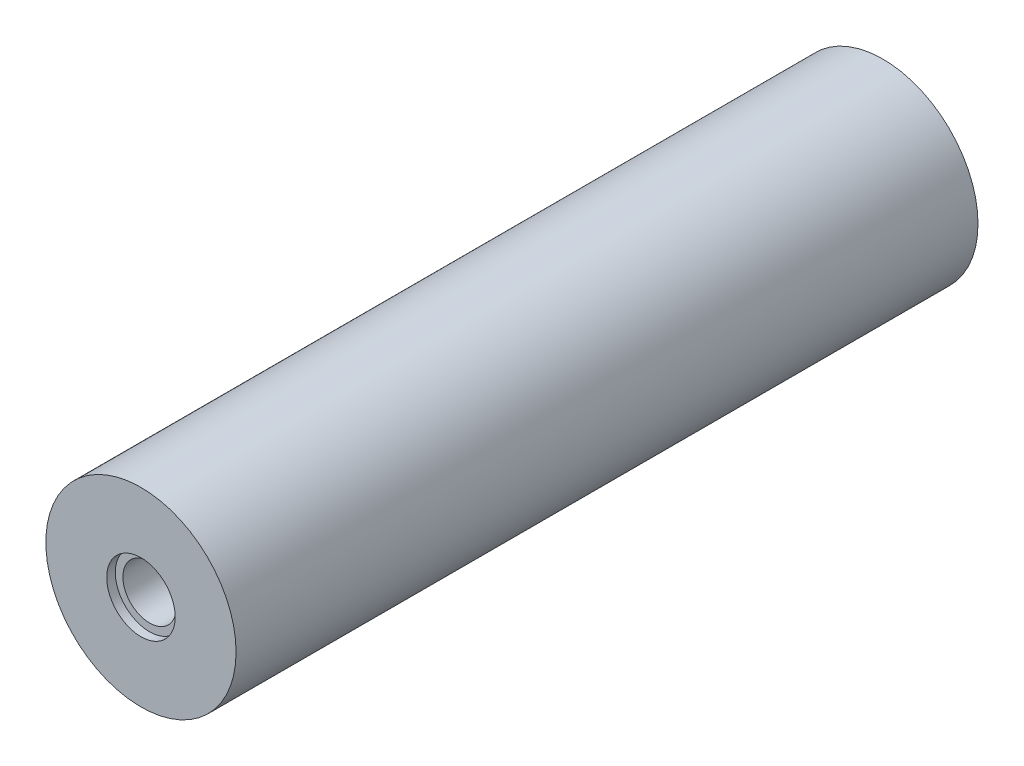
ISO-10303-21;
HEADER;
FILE_DESCRIPTION(('STEP AP214'),'2;1');
FILE_NAME('part.step','',(''),(''),'','','');
FILE_SCHEMA(('AUTOMOTIVE_DESIGN { 1 0 10303 214 1 1 1 1 }'));
ENDSEC;
DATA;
#1=APPLICATION_CONTEXT('core data for automotive mechanical design processes');
#2=APPLICATION_PROTOCOL_DEFINITION('international standard','automotive_design',2000,#1);
#3=PRODUCT_CONTEXT('',#1,'mechanical');
#4=PRODUCT('Part','Part','',(#3));
#5=PRODUCT_RELATED_PRODUCT_CATEGORY('part','',(#4));
#6=PRODUCT_DEFINITION_FORMATION('','',#4);
#7=PRODUCT_DEFINITION_CONTEXT('part definition',#1,'design');
#8=PRODUCT_DEFINITION('design','',#6,#7);
#9=PRODUCT_DEFINITION_SHAPE('','',#8);
#10=(LENGTH_UNIT() NAMED_UNIT(*) SI_UNIT(.MILLI.,.METRE.));
#11=(NAMED_UNIT(*) PLANE_ANGLE_UNIT() SI_UNIT($,.RADIAN.));
#12=(NAMED_UNIT(*) SI_UNIT($,.STERADIAN.) SOLID_ANGLE_UNIT());
#13=UNCERTAINTY_MEASURE_WITH_UNIT(LENGTH_MEASURE(1.E-05),#10,'distance_accuracy_value','');
#14=(GEOMETRIC_REPRESENTATION_CONTEXT(3) GLOBAL_UNCERTAINTY_ASSIGNED_CONTEXT((#13)) GLOBAL_UNIT_ASSIGNED_CONTEXT((#10,
#11,#12)) REPRESENTATION_CONTEXT('',''));
#15=CARTESIAN_POINT('',(0.,0.,0.));
#16=DIRECTION('',(0.,0.,1.));
#17=DIRECTION('',(1.,0.,0.));
#18=AXIS2_PLACEMENT_3D('',#15,#16,#17);
#19=CARTESIAN_POINT('',(0.,0.,78.));
#20=DIRECTION('',(0.,0.,-1.));
#21=DIRECTION('',(-1.,0.,0.));
#22=AXIS2_PLACEMENT_3D('',#19,#20,#21);
#23=CYLINDRICAL_SURFACE('',#22,10.);
#24=CARTESIAN_POINT('',(0.,0.,78.));
#25=DIRECTION('',(0.,0.,1.));
#26=DIRECTION('',(1.,0.,0.));
#27=AXIS2_PLACEMENT_3D('',#24,#25,#26);
#28=CIRCLE('',#27,10.);
#29=CARTESIAN_POINT('',(10.,0.,78.));
#30=VERTEX_POINT('',#29);
#31=EDGE_CURVE('E53',#30,#30,#28,.T.);
#32=ORIENTED_EDGE('',*,*,#31,.F.);
#33=EDGE_LOOP('',(#32));
#34=FACE_BOUND('',#33,.T.);
#35=CARTESIAN_POINT('',(0.,0.,0.));
#36=DIRECTION('',(0.,0.,1.));
#37=DIRECTION('',(1.,0.,0.));
#38=AXIS2_PLACEMENT_3D('',#35,#36,#37);
#39=CIRCLE('',#38,10.);
#40=CARTESIAN_POINT('',(10.,0.,0.));
#41=VERTEX_POINT('',#40);
#42=EDGE_CURVE('E57',#41,#41,#39,.T.);
#43=ORIENTED_EDGE('',*,*,#42,.T.);
#44=EDGE_LOOP('',(#43));
#45=FACE_BOUND('',#44,.T.);
#46=ADVANCED_FACE('F41',(#34,#45),#23,.T.);
#47=CARTESIAN_POINT('',(0.,0.,78.));
#48=DIRECTION('',(0.,0.,1.));
#49=DIRECTION('',(1.,0.,0.));
#50=AXIS2_PLACEMENT_3D('',#47,#48,#49);
#51=PLANE('',#50);
#52=CARTESIAN_POINT('',(0.,0.,78.));
#53=DIRECTION('',(0.,0.,1.));
#54=DIRECTION('',(1.,0.,0.));
#55=AXIS2_PLACEMENT_3D('',#52,#53,#54);
#56=CIRCLE('',#55,3.6);
#57=CARTESIAN_POINT('',(3.6,0.,78.));
#58=VERTEX_POINT('',#57);
#59=EDGE_CURVE('E69',#58,#58,#56,.T.);
#60=ORIENTED_EDGE('',*,*,#59,.F.);
#61=EDGE_LOOP('',(#60));
#62=FACE_BOUND('',#61,.T.);
#63=ORIENTED_EDGE('',*,*,#31,.T.);
#64=EDGE_LOOP('',(#63));
#65=FACE_BOUND('',#64,.T.);
#66=ADVANCED_FACE('F96',(#62,#65),#51,.T.);
#67=CARTESIAN_POINT('',(0.,0.,0.));
#68=DIRECTION('',(0.,0.,1.));
#69=DIRECTION('',(1.,0.,0.));
#70=AXIS2_PLACEMENT_3D('',#67,#68,#69);
#71=PLANE('',#70);
#72=CARTESIAN_POINT('',(0.,0.,0.));
#73=DIRECTION('',(0.,0.,1.));
#74=DIRECTION('',(1.,0.,0.));
#75=AXIS2_PLACEMENT_3D('',#72,#73,#74);
#76=CIRCLE('',#75,2.15265396141695);
#77=CARTESIAN_POINT('',(2.15265396141695,0.,0.));
#78=VERTEX_POINT('',#77);
#79=EDGE_CURVE('E10',#78,#78,#76,.T.);
#80=ORIENTED_EDGE('',*,*,#79,.T.);
#81=EDGE_LOOP('',(#80));
#82=FACE_BOUND('',#81,.T.);
#83=ORIENTED_EDGE('',*,*,#42,.F.);
#84=EDGE_LOOP('',(#83));
#85=FACE_BOUND('',#84,.T.);
#86=ADVANCED_FACE('F102',(#82,#85),#71,.F.);
#87=CARTESIAN_POINT('',(0.,0.,77.1));
#88=DIRECTION('',(0.,0.,1.));
#89=DIRECTION('',(1.,0.,0.));
#90=AXIS2_PLACEMENT_3D('',#87,#88,#89);
#91=PLANE('',#90);
#92=CARTESIAN_POINT('',(0.,0.,77.1));
#93=DIRECTION('',(0.,0.,1.));
#94=DIRECTION('',(1.,0.,0.));
#95=AXIS2_PLACEMENT_3D('',#92,#93,#94);
#96=CIRCLE('',#95,3.6);
#97=CARTESIAN_POINT('',(3.6,0.,77.1));
#98=VERTEX_POINT('',#97);
#99=EDGE_CURVE('E64',#98,#98,#96,.T.);
#100=ORIENTED_EDGE('',*,*,#99,.T.);
#101=EDGE_LOOP('',(#100));
#102=FACE_BOUND('',#101,.T.);
#103=CARTESIAN_POINT('',(0.,0.,77.1));
#104=DIRECTION('',(0.,0.,1.));
#105=DIRECTION('',(1.,0.,0.));
#106=AXIS2_PLACEMENT_3D('',#103,#104,#105);
#107=CIRCLE('',#106,2.8);
#108=CARTESIAN_POINT('',(2.8,0.,77.1));
#109=VERTEX_POINT('',#108);
#110=EDGE_CURVE('E60',#109,#109,#107,.F.);
#111=ORIENTED_EDGE('',*,*,#110,.T.);
#112=EDGE_LOOP('',(#111));
#113=FACE_BOUND('',#112,.T.);
#114=ADVANCED_FACE('F108',(#102,#113),#91,.T.);
#115=CARTESIAN_POINT('',(0.,0.,77.1));
#116=DIRECTION('',(0.,0.,1.));
#117=DIRECTION('',(1.,0.,0.));
#118=AXIS2_PLACEMENT_3D('',#115,#116,#117);
#119=CYLINDRICAL_SURFACE('',#118,3.6);
#120=ORIENTED_EDGE('',*,*,#99,.F.);
#121=EDGE_LOOP('',(#120));
#122=FACE_BOUND('',#121,.T.);
#123=ORIENTED_EDGE('',*,*,#59,.T.);
#124=EDGE_LOOP('',(#123));
#125=FACE_BOUND('',#124,.T.);
#126=ADVANCED_FACE('F111',(#122,#125),#119,.F.);
#127=CARTESIAN_POINT('',(0.,0.,58.));
#128=DIRECTION('',(0.,0.,1.));
#129=DIRECTION('',(1.,0.,0.));
#130=AXIS2_PLACEMENT_3D('',#127,#128,#129);
#131=PLANE('',#130);
#132=CARTESIAN_POINT('',(0.,0.,58.));
#133=DIRECTION('',(0.,0.,1.));
#134=DIRECTION('',(1.,0.,0.));
#135=AXIS2_PLACEMENT_3D('',#132,#133,#134);
#136=CIRCLE('',#135,2.8);
#137=CARTESIAN_POINT('',(2.8,0.,58.));
#138=VERTEX_POINT('',#137);
#139=EDGE_CURVE('E63',#138,#138,#136,.T.);
#140=ORIENTED_EDGE('',*,*,#139,.T.);
#141=EDGE_LOOP('',(#140));
#142=FACE_BOUND('',#141,.T.);
#143=ADVANCED_FACE('F91',(#142),#131,.T.);
#144=CARTESIAN_POINT('',(0.,0.,58.));
#145=DIRECTION('',(0.,0.,1.));
#146=DIRECTION('',(1.,0.,0.));
#147=AXIS2_PLACEMENT_3D('',#144,#145,#146);
#148=CYLINDRICAL_SURFACE('',#147,2.8);
#149=ORIENTED_EDGE('',*,*,#139,.F.);
#150=EDGE_LOOP('',(#149));
#151=FACE_BOUND('',#150,.T.);
#152=ORIENTED_EDGE('',*,*,#110,.F.);
#153=EDGE_LOOP('',(#152));
#154=FACE_BOUND('',#153,.T.);
#155=ADVANCED_FACE('F82',(#151,#154),#148,.F.);
#156=CARTESIAN_POINT('',(0.,0.,20.));
#157=DIRECTION('',(0.,0.,-1.));
#158=DIRECTION('',(-1.,0.,0.));
#159=AXIS2_PLACEMENT_3D('',#156,#157,#158);
#160=CYLINDRICAL_SURFACE('',#159,1.8);
#161=CARTESIAN_POINT('',(0.,0.,2.00000000000012));
#162=DIRECTION('',(0.,0.,1.));
#163=DIRECTION('',(1.,0.,0.));
#164=AXIS2_PLACEMENT_3D('',#161,#162,#163);
#165=CIRCLE('',#164,1.8);
#166=CARTESIAN_POINT('',(1.8,0.,2.00000000000012));
#167=VERTEX_POINT('',#166);
#168=EDGE_CURVE('E49',#167,#167,#165,.F.);
#169=ORIENTED_EDGE('',*,*,#168,.T.);
#170=EDGE_LOOP('',(#169));
#171=FACE_BOUND('',#170,.T.);
#172=CARTESIAN_POINT('',(0.,0.,20.));
#173=DIRECTION('',(0.,0.,-1.));
#174=DIRECTION('',(-1.,0.,0.));
#175=AXIS2_PLACEMENT_3D('',#172,#173,#174);
#176=CIRCLE('',#175,1.8);
#177=CARTESIAN_POINT('',(-1.8,0.,20.));
#178=VERTEX_POINT('',#177);
#179=EDGE_CURVE('E72',#178,#178,#176,.T.);
#180=ORIENTED_EDGE('',*,*,#179,.F.);
#181=EDGE_LOOP('',(#180));
#182=FACE_BOUND('',#181,.T.);
#183=ADVANCED_FACE('F80',(#171,#182),#160,.F.);
#184=CARTESIAN_POINT('',(0.,0.,20.));
#185=DIRECTION('',(0.,0.,-1.));
#186=DIRECTION('',(-1.,0.,0.));
#187=AXIS2_PLACEMENT_3D('',#184,#185,#186);
#188=PLANE('',#187);
#189=ORIENTED_EDGE('',*,*,#179,.T.);
#190=EDGE_LOOP('',(#189));
#191=FACE_BOUND('',#190,.T.);
#192=ADVANCED_FACE('F78',(#191),#188,.T.);
#193=CARTESIAN_POINT('',(0.,0.,2.00000000000012));
#194=DIRECTION('',(0.,0.,-1.));
#195=DIRECTION('',(-1.,0.,0.));
#196=AXIS2_PLACEMENT_3D('',#193,#194,#195);
#197=CONICAL_SURFACE('',#196,1.8,0.17453292519943);
#198=ORIENTED_EDGE('',*,*,#79,.F.);
#199=EDGE_LOOP('',(#198));
#200=FACE_BOUND('',#199,.T.);
#201=ORIENTED_EDGE('',*,*,#168,.F.);
#202=EDGE_LOOP('',(#201));
#203=FACE_BOUND('',#202,.T.);
#204=ADVANCED_FACE('F44',(#200,#203),#197,.F.);
#205=CLOSED_SHELL('',(#46,#66,#86,#114,#126,#143,#155,#183,#192,#204));
#206=MANIFOLD_SOLID_BREP('B2',#205);
#207=ADVANCED_BREP_SHAPE_REPRESENTATION('',(#18,#206),#14);
#208=SHAPE_DEFINITION_REPRESENTATION(#9,#207);
ENDSEC;
END-ISO-10303-21;
